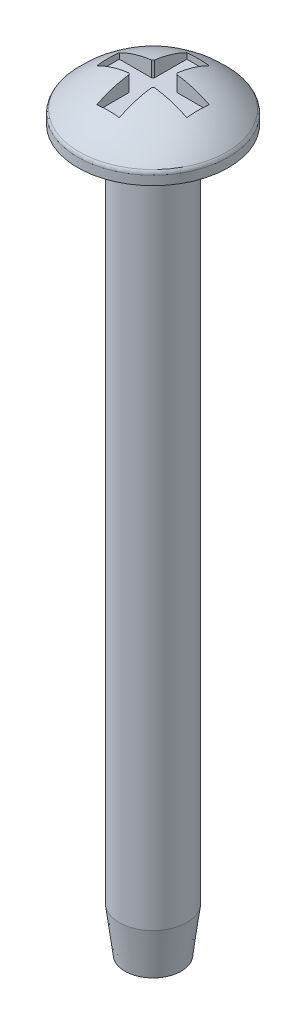
ISO-10303-21;
HEADER;
FILE_DESCRIPTION(('STEP AP214'),'2;1');
FILE_NAME('part.step','',(''),(''),'','','');
FILE_SCHEMA(('AUTOMOTIVE_DESIGN { 1 0 10303 214 1 1 1 1 }'));
ENDSEC;
DATA;
#1=APPLICATION_CONTEXT('core data for automotive mechanical design processes');
#2=APPLICATION_PROTOCOL_DEFINITION('international standard','automotive_design',2000,#1);
#3=PRODUCT_CONTEXT('',#1,'mechanical');
#4=PRODUCT('Part','Part','',(#3));
#5=PRODUCT_RELATED_PRODUCT_CATEGORY('part','',(#4));
#6=PRODUCT_DEFINITION_FORMATION('','',#4);
#7=PRODUCT_DEFINITION_CONTEXT('part definition',#1,'design');
#8=PRODUCT_DEFINITION('design','',#6,#7);
#9=PRODUCT_DEFINITION_SHAPE('','',#8);
#10=(LENGTH_UNIT() NAMED_UNIT(*) SI_UNIT(.MILLI.,.METRE.));
#11=(NAMED_UNIT(*) PLANE_ANGLE_UNIT() SI_UNIT($,.RADIAN.));
#12=(NAMED_UNIT(*) SI_UNIT($,.STERADIAN.) SOLID_ANGLE_UNIT());
#13=UNCERTAINTY_MEASURE_WITH_UNIT(LENGTH_MEASURE(1.E-05),#10,'distance_accuracy_value','');
#14=(GEOMETRIC_REPRESENTATION_CONTEXT(3) GLOBAL_UNCERTAINTY_ASSIGNED_CONTEXT((#13)) GLOBAL_UNIT_ASSIGNED_CONTEXT((#10,
#11,#12)) REPRESENTATION_CONTEXT('',''));
#15=CARTESIAN_POINT('',(0.,0.,0.));
#16=DIRECTION('',(0.,0.,1.));
#17=DIRECTION('',(1.,0.,0.));
#18=AXIS2_PLACEMENT_3D('',#15,#16,#17);
#19=CARTESIAN_POINT('',(0.,0.,0.));
#20=DIRECTION('',(0.,-1.,0.));
#21=DIRECTION('',(1.,0.,0.));
#22=AXIS2_PLACEMENT_3D('',#19,#20,#21);
#23=SPHERICAL_SURFACE('',#22,4.5);
#24=CARTESIAN_POINT('',(0.,3.07369941468059,0.));
#25=DIRECTION('',(0.,-1.,0.));
#26=DIRECTION('',(0.,0.,-1.));
#27=AXIS2_PLACEMENT_3D('',#24,#25,#26);
#28=CIRCLE('',#27,3.28669619955849);
#29=CARTESIAN_POINT('',(0.,3.07369941468059,-3.28669619955849));
#30=VERTEX_POINT('',#29);
#31=EDGE_CURVE('E173',#30,#30,#28,.F.);
#32=ORIENTED_EDGE('',*,*,#31,.T.);
#33=EDGE_LOOP('',(#32));
#34=FACE_BOUND('',#33,.T.);
#35=CARTESIAN_POINT('',(-0.5,0.,0.));
#36=DIRECTION('',(1.,0.,0.));
#37=DIRECTION('',(0.,0.,-1.));
#38=AXIS2_PLACEMENT_3D('',#35,#36,#37);
#39=CIRCLE('',#38,4.47213595499958);
#40=CARTESIAN_POINT('',(-0.5,4.43705983732471,-0.559016994374947));
#41=VERTEX_POINT('',#40);
#42=CARTESIAN_POINT('',(-0.5,4.,-2.));
#43=VERTEX_POINT('',#42);
#44=EDGE_CURVE('E182',#41,#43,#39,.F.);
#45=ORIENTED_EDGE('',*,*,#44,.T.);
#46=CARTESIAN_POINT('',(0.,0.,-2.));
#47=DIRECTION('',(0.,0.,1.));
#48=DIRECTION('',(1.,0.,0.));
#49=AXIS2_PLACEMENT_3D('',#46,#47,#48);
#50=CIRCLE('',#49,4.03112887414927);
#51=CARTESIAN_POINT('',(0.5,4.,-2.));
#52=VERTEX_POINT('',#51);
#53=EDGE_CURVE('E11',#43,#52,#50,.F.);
#54=ORIENTED_EDGE('',*,*,#53,.T.);
#55=CARTESIAN_POINT('',(0.5,0.,0.));
#56=DIRECTION('',(-1.,0.,0.));
#57=DIRECTION('',(0.,0.,1.));
#58=AXIS2_PLACEMENT_3D('',#55,#56,#57);
#59=CIRCLE('',#58,4.47213595499958);
#60=CARTESIAN_POINT('',(0.5,4.43705983732471,-0.559016994374947));
#61=VERTEX_POINT('',#60);
#62=EDGE_CURVE('E38',#52,#61,#59,.F.);
#63=ORIENTED_EDGE('',*,*,#62,.T.);
#64=CARTESIAN_POINT('',(0.,4.43705983732471,0.));
#65=DIRECTION('',(0.,-1.,0.));
#66=DIRECTION('',(0.,0.,-1.));
#67=AXIS2_PLACEMENT_3D('',#64,#65,#66);
#68=CIRCLE('',#67,0.75);
#69=CARTESIAN_POINT('',(0.559016994374942,4.43705983732471,-0.500000000000006));
#70=VERTEX_POINT('',#69);
#71=EDGE_CURVE('E221',#61,#70,#68,.T.);
#72=ORIENTED_EDGE('',*,*,#71,.T.);
#73=CARTESIAN_POINT('',(0.,0.,-0.5));
#74=DIRECTION('',(0.,0.,1.));
#75=DIRECTION('',(1.,0.,0.));
#76=AXIS2_PLACEMENT_3D('',#73,#74,#75);
#77=CIRCLE('',#76,4.47213595499958);
#78=CARTESIAN_POINT('',(1.99999999999999,4.,-0.500000000000021));
#79=VERTEX_POINT('',#78);
#80=EDGE_CURVE('E218',#70,#79,#77,.F.);
#81=ORIENTED_EDGE('',*,*,#80,.T.);
#82=CARTESIAN_POINT('',(2.,0.,0.));
#83=DIRECTION('',(-1.,0.,0.));
#84=DIRECTION('',(0.,0.,1.));
#85=AXIS2_PLACEMENT_3D('',#82,#83,#84);
#86=CIRCLE('',#85,4.03112887414927);
#87=CARTESIAN_POINT('',(2.00000000000001,4.,0.499999999999979));
#88=VERTEX_POINT('',#87);
#89=EDGE_CURVE('E215',#79,#88,#86,.F.);
#90=ORIENTED_EDGE('',*,*,#89,.T.);
#91=CARTESIAN_POINT('',(0.,0.,0.5));
#92=DIRECTION('',(0.,0.,-1.));
#93=DIRECTION('',(-1.,0.,0.));
#94=AXIS2_PLACEMENT_3D('',#91,#92,#93);
#95=CIRCLE('',#94,4.47213595499958);
#96=CARTESIAN_POINT('',(0.559016994374952,4.43705983732471,0.499999999999994));
#97=VERTEX_POINT('',#96);
#98=EDGE_CURVE('E212',#88,#97,#95,.F.);
#99=ORIENTED_EDGE('',*,*,#98,.T.);
#100=CARTESIAN_POINT('',(0.,4.43705983732471,0.));
#101=DIRECTION('',(0.,-1.,0.));
#102=DIRECTION('',(0.,0.,-1.));
#103=AXIS2_PLACEMENT_3D('',#100,#101,#102);
#104=CIRCLE('',#103,0.75);
#105=CARTESIAN_POINT('',(0.500000000000004,4.43705983732471,0.559016994374944));
#106=VERTEX_POINT('',#105);
#107=EDGE_CURVE('E209',#97,#106,#104,.T.);
#108=ORIENTED_EDGE('',*,*,#107,.T.);
#109=CARTESIAN_POINT('',(0.5,0.,0.));
#110=DIRECTION('',(-1.,0.,0.));
#111=DIRECTION('',(0.,0.,1.));
#112=AXIS2_PLACEMENT_3D('',#109,#110,#111);
#113=CIRCLE('',#112,4.47213595499958);
#114=CARTESIAN_POINT('',(0.500000000000014,4.,2.));
#115=VERTEX_POINT('',#114);
#116=EDGE_CURVE('E206',#106,#115,#113,.F.);
#117=ORIENTED_EDGE('',*,*,#116,.T.);
#118=CARTESIAN_POINT('',(0.,0.,2.));
#119=DIRECTION('',(0.,0.,-1.));
#120=DIRECTION('',(-1.,0.,0.));
#121=AXIS2_PLACEMENT_3D('',#118,#119,#120);
#122=CIRCLE('',#121,4.03112887414927);
#123=CARTESIAN_POINT('',(-0.499999999999986,4.,2.));
#124=VERTEX_POINT('',#123);
#125=EDGE_CURVE('E203',#115,#124,#122,.F.);
#126=ORIENTED_EDGE('',*,*,#125,.T.);
#127=CARTESIAN_POINT('',(-0.5,0.,0.));
#128=DIRECTION('',(1.,0.,0.));
#129=DIRECTION('',(0.,0.,-1.));
#130=AXIS2_PLACEMENT_3D('',#127,#128,#129);
#131=CIRCLE('',#130,4.47213595499958);
#132=CARTESIAN_POINT('',(-0.499999999999996,4.43705983732471,0.559016994374951));
#133=VERTEX_POINT('',#132);
#134=EDGE_CURVE('E200',#124,#133,#131,.F.);
#135=ORIENTED_EDGE('',*,*,#134,.T.);
#136=CARTESIAN_POINT('',(0.,4.43705983732471,0.));
#137=DIRECTION('',(0.,-1.,0.));
#138=DIRECTION('',(0.,0.,-1.));
#139=AXIS2_PLACEMENT_3D('',#136,#137,#138);
#140=CIRCLE('',#139,0.75);
#141=CARTESIAN_POINT('',(-0.559016994374946,4.43705983732471,0.500000000000002));
#142=VERTEX_POINT('',#141);
#143=EDGE_CURVE('E197',#133,#142,#140,.T.);
#144=ORIENTED_EDGE('',*,*,#143,.T.);
#145=CARTESIAN_POINT('',(0.,0.,0.5));
#146=DIRECTION('',(0.,0.,-1.));
#147=DIRECTION('',(-1.,0.,0.));
#148=AXIS2_PLACEMENT_3D('',#145,#146,#147);
#149=CIRCLE('',#148,4.47213595499958);
#150=CARTESIAN_POINT('',(-2.,4.,0.500000000000007));
#151=VERTEX_POINT('',#150);
#152=EDGE_CURVE('E194',#142,#151,#149,.F.);
#153=ORIENTED_EDGE('',*,*,#152,.T.);
#154=CARTESIAN_POINT('',(-2.,0.,0.));
#155=DIRECTION('',(1.,0.,0.));
#156=DIRECTION('',(0.,0.,-1.));
#157=AXIS2_PLACEMENT_3D('',#154,#155,#156);
#158=CIRCLE('',#157,4.03112887414927);
#159=CARTESIAN_POINT('',(-2.,4.,-0.499999999999993));
#160=VERTEX_POINT('',#159);
#161=EDGE_CURVE('E191',#151,#160,#158,.F.);
#162=ORIENTED_EDGE('',*,*,#161,.T.);
#163=CARTESIAN_POINT('',(0.,0.,-0.5));
#164=DIRECTION('',(0.,0.,1.));
#165=DIRECTION('',(1.,0.,0.));
#166=AXIS2_PLACEMENT_3D('',#163,#164,#165);
#167=CIRCLE('',#166,4.47213595499958);
#168=CARTESIAN_POINT('',(-0.559016994374949,4.43705983732471,-0.499999999999998));
#169=VERTEX_POINT('',#168);
#170=EDGE_CURVE('E188',#160,#169,#167,.F.);
#171=ORIENTED_EDGE('',*,*,#170,.T.);
#172=CARTESIAN_POINT('',(0.,4.43705983732471,0.));
#173=DIRECTION('',(0.,-1.,0.));
#174=DIRECTION('',(0.,0.,-1.));
#175=AXIS2_PLACEMENT_3D('',#172,#173,#174);
#176=CIRCLE('',#175,0.75);
#177=EDGE_CURVE('E185',#169,#41,#176,.T.);
#178=ORIENTED_EDGE('',*,*,#177,.T.);
#179=EDGE_LOOP('',(#45,#54,#63,#72,#81,#90,#99,#108,#117,#126,#135,#144,#153,#162,#171,#178));
#180=FACE_BOUND('',#179,.T.);
#181=ADVANCED_FACE('F31',(#34,#180),#23,.T.);
#182=CARTESIAN_POINT('',(0.,2.5,0.));
#183=DIRECTION('',(0.,-1.,0.));
#184=DIRECTION('',(0.,0.,-1.));
#185=AXIS2_PLACEMENT_3D('',#182,#183,#184);
#186=PLANE('',#185);
#187=CARTESIAN_POINT('',(0.,2.5,0.));
#188=DIRECTION('',(0.,-1.,0.));
#189=DIRECTION('',(0.,0.,-1.));
#190=AXIS2_PLACEMENT_3D('',#187,#188,#189);
#191=CIRCLE('',#190,3.35410196624968);
#192=CARTESIAN_POINT('',(0.,2.5,-3.35410196624968));
#193=VERTEX_POINT('',#192);
#194=EDGE_CURVE('E162',#193,#193,#191,.T.);
#195=ORIENTED_EDGE('',*,*,#194,.T.);
#196=EDGE_LOOP('',(#195));
#197=FACE_BOUND('',#196,.T.);
#198=CARTESIAN_POINT('',(0.,2.5,0.));
#199=DIRECTION('',(0.,-1.,0.));
#200=DIRECTION('',(0.,0.,-1.));
#201=AXIS2_PLACEMENT_3D('',#198,#199,#200);
#202=CIRCLE('',#201,1.5);
#203=CARTESIAN_POINT('',(0.,2.5,-1.5));
#204=VERTEX_POINT('',#203);
#205=EDGE_CURVE('E158',#204,#204,#202,.T.);
#206=ORIENTED_EDGE('',*,*,#205,.F.);
#207=EDGE_LOOP('',(#206));
#208=FACE_BOUND('',#207,.T.);
#209=ADVANCED_FACE('F349',(#197,#208),#186,.T.);
#210=CARTESIAN_POINT('',(0.,2.5,0.));
#211=DIRECTION('',(0.,1.,0.));
#212=DIRECTION('',(0.,0.,1.));
#213=AXIS2_PLACEMENT_3D('',#210,#211,#212);
#214=CYLINDRICAL_SURFACE('',#213,3.35410196624968);
#215=CARTESIAN_POINT('',(0.,2.90293833608722,0.));
#216=DIRECTION('',(0.,-1.,0.));
#217=DIRECTION('',(0.,0.,-1.));
#218=AXIS2_PLACEMENT_3D('',#215,#216,#217);
#219=CIRCLE('',#218,3.35410196624968);
#220=CARTESIAN_POINT('',(0.,2.90293833608722,-3.35410196624968));
#221=VERTEX_POINT('',#220);
#222=EDGE_CURVE('E170',#221,#221,#219,.T.);
#223=ORIENTED_EDGE('',*,*,#222,.T.);
#224=EDGE_LOOP('',(#223));
#225=FACE_BOUND('',#224,.T.);
#226=ORIENTED_EDGE('',*,*,#194,.F.);
#227=EDGE_LOOP('',(#226));
#228=FACE_BOUND('',#227,.T.);
#229=ADVANCED_FACE('F354',(#225,#228),#214,.T.);
#230=CARTESIAN_POINT('',(0.,2.90293833608722,0.));
#231=DIRECTION('',(0.,-1.,0.));
#232=DIRECTION('',(0.,0.,-1.));
#233=AXIS2_PLACEMENT_3D('',#230,#231,#232);
#234=TOROIDAL_SURFACE('',#233,3.10410196624968,0.25);
#235=ORIENTED_EDGE('',*,*,#31,.F.);
#236=EDGE_LOOP('',(#235));
#237=FACE_BOUND('',#236,.T.);
#238=ORIENTED_EDGE('',*,*,#222,.F.);
#239=EDGE_LOOP('',(#238));
#240=FACE_BOUND('',#239,.T.);
#241=ADVANCED_FACE('F359',(#237,#240),#234,.T.);
#242=CARTESIAN_POINT('',(0.,-29.5,0.));
#243=DIRECTION('',(0.,1.,0.));
#244=DIRECTION('',(0.,0.,1.));
#245=AXIS2_PLACEMENT_3D('',#242,#243,#244);
#246=CYLINDRICAL_SURFACE('',#245,1.5);
#247=CARTESIAN_POINT('',(0.,-27.5,0.));
#248=DIRECTION('',(0.,-1.,0.));
#249=DIRECTION('',(0.,0.,-1.));
#250=AXIS2_PLACEMENT_3D('',#247,#248,#249);
#251=CIRCLE('',#250,1.5);
#252=CARTESIAN_POINT('',(0.,-27.5,-1.5));
#253=VERTEX_POINT('',#252);
#254=EDGE_CURVE('E179',#253,#253,#251,.F.);
#255=ORIENTED_EDGE('',*,*,#254,.T.);
#256=EDGE_LOOP('',(#255));
#257=FACE_BOUND('',#256,.T.);
#258=ORIENTED_EDGE('',*,*,#205,.T.);
#259=EDGE_LOOP('',(#258));
#260=FACE_BOUND('',#259,.T.);
#261=ADVANCED_FACE('F362',(#257,#260),#246,.T.);
#262=CARTESIAN_POINT('',(0.,-29.5,0.));
#263=DIRECTION('',(0.,-1.,0.));
#264=DIRECTION('',(0.,0.,-1.));
#265=AXIS2_PLACEMENT_3D('',#262,#263,#264);
#266=PLANE('',#265);
#267=CARTESIAN_POINT('',(0.,-29.5,0.));
#268=DIRECTION('',(0.,-1.,0.));
#269=DIRECTION('',(0.,0.,-1.));
#270=AXIS2_PLACEMENT_3D('',#267,#268,#269);
#271=CIRCLE('',#270,1.25);
#272=CARTESIAN_POINT('',(0.,-29.5,-1.25));
#273=VERTEX_POINT('',#272);
#274=EDGE_CURVE('E176',#273,#273,#271,.T.);
#275=ORIENTED_EDGE('',*,*,#274,.T.);
#276=EDGE_LOOP('',(#275));
#277=FACE_BOUND('',#276,.T.);
#278=ADVANCED_FACE('F373',(#277),#266,.T.);
#279=CARTESIAN_POINT('',(0.,-29.5,0.));
#280=DIRECTION('',(0.,1.,0.));
#281=DIRECTION('',(0.,0.,1.));
#282=AXIS2_PLACEMENT_3D('',#279,#280,#281);
#283=CONICAL_SURFACE('',#282,1.25,0.124354994546762);
#284=ORIENTED_EDGE('',*,*,#254,.F.);
#285=EDGE_LOOP('',(#284));
#286=FACE_BOUND('',#285,.T.);
#287=ORIENTED_EDGE('',*,*,#274,.F.);
#288=EDGE_LOOP('',(#287));
#289=FACE_BOUND('',#288,.T.);
#290=ADVANCED_FACE('F379',(#286,#289),#283,.T.);
#291=CARTESIAN_POINT('',(-0.5,3.75,-2.));
#292=DIRECTION('',(0.,0.,1.));
#293=DIRECTION('',(1.,0.,0.));
#294=AXIS2_PLACEMENT_3D('',#291,#292,#293);
#295=PLANE('',#294);
#296=DIRECTION('',(0.,1.,0.));
#297=VECTOR('',#296,1.);
#298=CARTESIAN_POINT('',(-0.5,3.75,-2.));
#299=LINE('',#298,#297);
#300=CARTESIAN_POINT('',(-0.5,3.75,-2.));
#301=VERTEX_POINT('',#300);
#302=EDGE_CURVE('E45',#301,#43,#299,.T.);
#303=ORIENTED_EDGE('',*,*,#302,.F.);
#304=DIRECTION('',(1.,0.,0.));
#305=VECTOR('',#304,1.);
#306=CARTESIAN_POINT('',(-0.5,3.75,-2.));
#307=LINE('',#306,#305);
#308=CARTESIAN_POINT('',(0.5,3.75,-2.));
#309=VERTEX_POINT('',#308);
#310=EDGE_CURVE('E148',#301,#309,#307,.T.);
#311=ORIENTED_EDGE('',*,*,#310,.T.);
#312=DIRECTION('',(0.,1.,0.));
#313=VECTOR('',#312,1.);
#314=CARTESIAN_POINT('',(0.5,3.75,-2.));
#315=LINE('',#314,#313);
#316=EDGE_CURVE('E155',#309,#52,#315,.T.);
#317=ORIENTED_EDGE('',*,*,#316,.T.);
#318=ORIENTED_EDGE('',*,*,#53,.F.);
#319=EDGE_LOOP('',(#303,#311,#317,#318));
#320=FACE_BOUND('',#319,.T.);
#321=ADVANCED_FACE('F154',(#320),#295,.T.);
#322=CARTESIAN_POINT('',(0.5,3.75,-2.));
#323=DIRECTION('',(-1.,0.,0.));
#324=DIRECTION('',(0.,0.,1.));
#325=AXIS2_PLACEMENT_3D('',#322,#323,#324);
#326=PLANE('',#325);
#327=ORIENTED_EDGE('',*,*,#316,.F.);
#328=DIRECTION('',(0.,0.,1.));
#329=VECTOR('',#328,1.);
#330=CARTESIAN_POINT('',(0.5,3.75,-2.));
#331=LINE('',#330,#329);
#332=CARTESIAN_POINT('',(0.5,3.75,-0.559016994374947));
#333=VERTEX_POINT('',#332);
#334=EDGE_CURVE('E144',#309,#333,#331,.T.);
#335=ORIENTED_EDGE('',*,*,#334,.T.);
#336=DIRECTION('',(0.,1.,0.));
#337=VECTOR('',#336,1.);
#338=CARTESIAN_POINT('',(0.5,3.75,-0.559016994374947));
#339=LINE('',#338,#337);
#340=EDGE_CURVE('E159',#333,#61,#339,.T.);
#341=ORIENTED_EDGE('',*,*,#340,.T.);
#342=ORIENTED_EDGE('',*,*,#62,.F.);
#343=EDGE_LOOP('',(#327,#335,#341,#342));
#344=FACE_BOUND('',#343,.T.);
#345=ADVANCED_FACE('F157',(#344),#326,.T.);
#346=CARTESIAN_POINT('',(0.,3.75,0.));
#347=DIRECTION('',(0.,1.,0.));
#348=DIRECTION('',(0.,0.,1.));
#349=AXIS2_PLACEMENT_3D('',#346,#347,#348);
#350=CYLINDRICAL_SURFACE('',#349,0.75);
#351=ORIENTED_EDGE('',*,*,#340,.F.);
#352=CARTESIAN_POINT('',(0.,3.75,0.));
#353=DIRECTION('',(0.,-1.,0.));
#354=DIRECTION('',(0.,0.,-1.));
#355=AXIS2_PLACEMENT_3D('',#352,#353,#354);
#356=CIRCLE('',#355,0.75);
#357=CARTESIAN_POINT('',(0.559016994374942,3.75,-0.500000000000006));
#358=VERTEX_POINT('',#357);
#359=EDGE_CURVE('E150',#333,#358,#356,.T.);
#360=ORIENTED_EDGE('',*,*,#359,.T.);
#361=DIRECTION('',(0.,1.,0.));
#362=VECTOR('',#361,1.);
#363=CARTESIAN_POINT('',(0.559016994374942,3.75,-0.500000000000006));
#364=LINE('',#363,#362);
#365=EDGE_CURVE('E164',#358,#70,#364,.T.);
#366=ORIENTED_EDGE('',*,*,#365,.T.);
#367=ORIENTED_EDGE('',*,*,#71,.F.);
#368=EDGE_LOOP('',(#351,#360,#366,#367));
#369=FACE_BOUND('',#368,.T.);
#370=ADVANCED_FACE('F273',(#369),#350,.F.);
#371=CARTESIAN_POINT('',(1.99999999999999,3.75,-0.500000000000021));
#372=DIRECTION('',(0.,0.,1.));
#373=DIRECTION('',(1.,0.,0.));
#374=AXIS2_PLACEMENT_3D('',#371,#372,#373);
#375=PLANE('',#374);
#376=ORIENTED_EDGE('',*,*,#365,.F.);
#377=DIRECTION('',(1.,0.,0.));
#378=VECTOR('',#377,1.);
#379=CARTESIAN_POINT('',(1.99999999999999,3.75,-0.500000000000021));
#380=LINE('',#379,#378);
#381=CARTESIAN_POINT('',(1.99999999999999,3.75,-0.500000000000021));
#382=VERTEX_POINT('',#381);
#383=EDGE_CURVE('E276',#358,#382,#380,.T.);
#384=ORIENTED_EDGE('',*,*,#383,.T.);
#385=DIRECTION('',(0.,1.,0.));
#386=VECTOR('',#385,1.);
#387=CARTESIAN_POINT('',(1.99999999999999,3.75,-0.500000000000021));
#388=LINE('',#387,#386);
#389=EDGE_CURVE('E268',#382,#79,#388,.T.);
#390=ORIENTED_EDGE('',*,*,#389,.T.);
#391=ORIENTED_EDGE('',*,*,#80,.F.);
#392=EDGE_LOOP('',(#376,#384,#390,#391));
#393=FACE_BOUND('',#392,.T.);
#394=ADVANCED_FACE('F275',(#393),#375,.T.);
#395=CARTESIAN_POINT('',(1.99999999999999,3.75,-0.500000000000021));
#396=DIRECTION('',(-1.,0.,0.));
#397=DIRECTION('',(0.,0.,1.));
#398=AXIS2_PLACEMENT_3D('',#395,#396,#397);
#399=PLANE('',#398);
#400=ORIENTED_EDGE('',*,*,#389,.F.);
#401=DIRECTION('',(0.,0.,1.));
#402=VECTOR('',#401,1.);
#403=CARTESIAN_POINT('',(1.99999999999999,3.75,-0.500000000000021));
#404=LINE('',#403,#402);
#405=CARTESIAN_POINT('',(2.00000000000001,3.75,0.499999999999979));
#406=VERTEX_POINT('',#405);
#407=EDGE_CURVE('E280',#382,#406,#404,.T.);
#408=ORIENTED_EDGE('',*,*,#407,.T.);
#409=DIRECTION('',(0.,1.,0.));
#410=VECTOR('',#409,1.);
#411=CARTESIAN_POINT('',(2.00000000000001,3.75,0.499999999999979));
#412=LINE('',#411,#410);
#413=EDGE_CURVE('E265',#406,#88,#412,.T.);
#414=ORIENTED_EDGE('',*,*,#413,.T.);
#415=ORIENTED_EDGE('',*,*,#89,.F.);
#416=EDGE_LOOP('',(#400,#408,#414,#415));
#417=FACE_BOUND('',#416,.T.);
#418=ADVANCED_FACE('F339',(#417),#399,.T.);
#419=CARTESIAN_POINT('',(2.00000000000001,3.75,0.499999999999979));
#420=DIRECTION('',(0.,0.,-1.));
#421=DIRECTION('',(-1.,0.,0.));
#422=AXIS2_PLACEMENT_3D('',#419,#420,#421);
#423=PLANE('',#422);
#424=ORIENTED_EDGE('',*,*,#413,.F.);
#425=DIRECTION('',(-1.,0.,0.));
#426=VECTOR('',#425,1.);
#427=CARTESIAN_POINT('',(2.00000000000001,3.75,0.499999999999979));
#428=LINE('',#427,#426);
#429=CARTESIAN_POINT('',(0.559016994374952,3.75,0.499999999999994));
#430=VERTEX_POINT('',#429);
#431=EDGE_CURVE('E282',#406,#430,#428,.T.);
#432=ORIENTED_EDGE('',*,*,#431,.T.);
#433=DIRECTION('',(0.,1.,0.));
#434=VECTOR('',#433,1.);
#435=CARTESIAN_POINT('',(0.559016994374952,3.75,0.499999999999994));
#436=LINE('',#435,#434);
#437=EDGE_CURVE('E262',#430,#97,#436,.T.);
#438=ORIENTED_EDGE('',*,*,#437,.T.);
#439=ORIENTED_EDGE('',*,*,#98,.F.);
#440=EDGE_LOOP('',(#424,#432,#438,#439));
#441=FACE_BOUND('',#440,.T.);
#442=ADVANCED_FACE('F337',(#441),#423,.T.);
#443=CARTESIAN_POINT('',(0.,3.75,0.));
#444=DIRECTION('',(0.,1.,0.));
#445=DIRECTION('',(0.,0.,1.));
#446=AXIS2_PLACEMENT_3D('',#443,#444,#445);
#447=CYLINDRICAL_SURFACE('',#446,0.75);
#448=ORIENTED_EDGE('',*,*,#437,.F.);
#449=CARTESIAN_POINT('',(0.,3.75,0.));
#450=DIRECTION('',(0.,-1.,0.));
#451=DIRECTION('',(0.,0.,-1.));
#452=AXIS2_PLACEMENT_3D('',#449,#450,#451);
#453=CIRCLE('',#452,0.75);
#454=CARTESIAN_POINT('',(0.500000000000004,3.75,0.559016994374944));
#455=VERTEX_POINT('',#454);
#456=EDGE_CURVE('E287',#430,#455,#453,.T.);
#457=ORIENTED_EDGE('',*,*,#456,.T.);
#458=DIRECTION('',(0.,1.,0.));
#459=VECTOR('',#458,1.);
#460=CARTESIAN_POINT('',(0.500000000000004,3.75,0.559016994374944));
#461=LINE('',#460,#459);
#462=EDGE_CURVE('E259',#455,#106,#461,.T.);
#463=ORIENTED_EDGE('',*,*,#462,.T.);
#464=ORIENTED_EDGE('',*,*,#107,.F.);
#465=EDGE_LOOP('',(#448,#457,#463,#464));
#466=FACE_BOUND('',#465,.T.);
#467=ADVANCED_FACE('F333',(#466),#447,.F.);
#468=CARTESIAN_POINT('',(0.500000000000014,3.75,2.));
#469=DIRECTION('',(-1.,0.,0.));
#470=DIRECTION('',(0.,0.,1.));
#471=AXIS2_PLACEMENT_3D('',#468,#469,#470);
#472=PLANE('',#471);
#473=ORIENTED_EDGE('',*,*,#462,.F.);
#474=DIRECTION('',(0.,0.,1.));
#475=VECTOR('',#474,1.);
#476=CARTESIAN_POINT('',(0.500000000000014,3.75,2.));
#477=LINE('',#476,#475);
#478=CARTESIAN_POINT('',(0.500000000000014,3.75,2.));
#479=VERTEX_POINT('',#478);
#480=EDGE_CURVE('E289',#455,#479,#477,.T.);
#481=ORIENTED_EDGE('',*,*,#480,.T.);
#482=DIRECTION('',(0.,1.,0.));
#483=VECTOR('',#482,1.);
#484=CARTESIAN_POINT('',(0.500000000000014,3.75,2.));
#485=LINE('',#484,#483);
#486=EDGE_CURVE('E256',#479,#115,#485,.T.);
#487=ORIENTED_EDGE('',*,*,#486,.T.);
#488=ORIENTED_EDGE('',*,*,#116,.F.);
#489=EDGE_LOOP('',(#473,#481,#487,#488));
#490=FACE_BOUND('',#489,.T.);
#491=ADVANCED_FACE('F330',(#490),#472,.T.);
#492=CARTESIAN_POINT('',(0.500000000000014,3.75,2.));
#493=DIRECTION('',(0.,0.,-1.));
#494=DIRECTION('',(-1.,0.,0.));
#495=AXIS2_PLACEMENT_3D('',#492,#493,#494);
#496=PLANE('',#495);
#497=ORIENTED_EDGE('',*,*,#486,.F.);
#498=DIRECTION('',(-1.,0.,0.));
#499=VECTOR('',#498,1.);
#500=CARTESIAN_POINT('',(0.500000000000014,3.75,2.));
#501=LINE('',#500,#499);
#502=CARTESIAN_POINT('',(-0.499999999999986,3.75,2.));
#503=VERTEX_POINT('',#502);
#504=EDGE_CURVE('E291',#479,#503,#501,.T.);
#505=ORIENTED_EDGE('',*,*,#504,.T.);
#506=DIRECTION('',(0.,1.,0.));
#507=VECTOR('',#506,1.);
#508=CARTESIAN_POINT('',(-0.499999999999986,3.75,2.));
#509=LINE('',#508,#507);
#510=EDGE_CURVE('E253',#503,#124,#509,.T.);
#511=ORIENTED_EDGE('',*,*,#510,.T.);
#512=ORIENTED_EDGE('',*,*,#125,.F.);
#513=EDGE_LOOP('',(#497,#505,#511,#512));
#514=FACE_BOUND('',#513,.T.);
#515=ADVANCED_FACE('F327',(#514),#496,.T.);
#516=CARTESIAN_POINT('',(-0.499999999999986,3.75,2.));
#517=DIRECTION('',(1.,0.,0.));
#518=DIRECTION('',(0.,0.,-1.));
#519=AXIS2_PLACEMENT_3D('',#516,#517,#518);
#520=PLANE('',#519);
#521=ORIENTED_EDGE('',*,*,#510,.F.);
#522=DIRECTION('',(0.,0.,-1.));
#523=VECTOR('',#522,1.);
#524=CARTESIAN_POINT('',(-0.499999999999986,3.75,2.));
#525=LINE('',#524,#523);
#526=CARTESIAN_POINT('',(-0.499999999999996,3.75,0.559016994374951));
#527=VERTEX_POINT('',#526);
#528=EDGE_CURVE('E293',#503,#527,#525,.T.);
#529=ORIENTED_EDGE('',*,*,#528,.T.);
#530=DIRECTION('',(0.,1.,0.));
#531=VECTOR('',#530,1.);
#532=CARTESIAN_POINT('',(-0.499999999999996,3.75,0.559016994374951));
#533=LINE('',#532,#531);
#534=EDGE_CURVE('E250',#527,#133,#533,.T.);
#535=ORIENTED_EDGE('',*,*,#534,.T.);
#536=ORIENTED_EDGE('',*,*,#134,.F.);
#537=EDGE_LOOP('',(#521,#529,#535,#536));
#538=FACE_BOUND('',#537,.T.);
#539=ADVANCED_FACE('F324',(#538),#520,.T.);
#540=CARTESIAN_POINT('',(0.,3.75,0.));
#541=DIRECTION('',(0.,1.,0.));
#542=DIRECTION('',(0.,0.,1.));
#543=AXIS2_PLACEMENT_3D('',#540,#541,#542);
#544=CYLINDRICAL_SURFACE('',#543,0.75);
#545=ORIENTED_EDGE('',*,*,#534,.F.);
#546=CARTESIAN_POINT('',(0.,3.75,0.));
#547=DIRECTION('',(0.,-1.,0.));
#548=DIRECTION('',(0.,0.,-1.));
#549=AXIS2_PLACEMENT_3D('',#546,#547,#548);
#550=CIRCLE('',#549,0.75);
#551=CARTESIAN_POINT('',(-0.559016994374946,3.75,0.500000000000002));
#552=VERTEX_POINT('',#551);
#553=EDGE_CURVE('E295',#527,#552,#550,.T.);
#554=ORIENTED_EDGE('',*,*,#553,.T.);
#555=DIRECTION('',(0.,1.,0.));
#556=VECTOR('',#555,1.);
#557=CARTESIAN_POINT('',(-0.559016994374946,3.75,0.500000000000002));
#558=LINE('',#557,#556);
#559=EDGE_CURVE('E247',#552,#142,#558,.T.);
#560=ORIENTED_EDGE('',*,*,#559,.T.);
#561=ORIENTED_EDGE('',*,*,#143,.F.);
#562=EDGE_LOOP('',(#545,#554,#560,#561));
#563=FACE_BOUND('',#562,.T.);
#564=ADVANCED_FACE('F317',(#563),#544,.F.);
#565=CARTESIAN_POINT('',(-2.,3.75,0.500000000000007));
#566=DIRECTION('',(0.,0.,-1.));
#567=DIRECTION('',(-1.,0.,0.));
#568=AXIS2_PLACEMENT_3D('',#565,#566,#567);
#569=PLANE('',#568);
#570=ORIENTED_EDGE('',*,*,#559,.F.);
#571=DIRECTION('',(-1.,0.,0.));
#572=VECTOR('',#571,1.);
#573=CARTESIAN_POINT('',(-2.,3.75,0.500000000000007));
#574=LINE('',#573,#572);
#575=CARTESIAN_POINT('',(-2.,3.75,0.500000000000007));
#576=VERTEX_POINT('',#575);
#577=EDGE_CURVE('E297',#552,#576,#574,.T.);
#578=ORIENTED_EDGE('',*,*,#577,.T.);
#579=DIRECTION('',(0.,1.,0.));
#580=VECTOR('',#579,1.);
#581=CARTESIAN_POINT('',(-2.,3.75,0.500000000000007));
#582=LINE('',#581,#580);
#583=EDGE_CURVE('E244',#576,#151,#582,.T.);
#584=ORIENTED_EDGE('',*,*,#583,.T.);
#585=ORIENTED_EDGE('',*,*,#152,.F.);
#586=EDGE_LOOP('',(#570,#578,#584,#585));
#587=FACE_BOUND('',#586,.T.);
#588=ADVANCED_FACE('F314',(#587),#569,.T.);
#589=CARTESIAN_POINT('',(-2.,3.75,0.500000000000007));
#590=DIRECTION('',(1.,0.,0.));
#591=DIRECTION('',(0.,0.,-1.));
#592=AXIS2_PLACEMENT_3D('',#589,#590,#591);
#593=PLANE('',#592);
#594=ORIENTED_EDGE('',*,*,#583,.F.);
#595=DIRECTION('',(0.,0.,-1.));
#596=VECTOR('',#595,1.);
#597=CARTESIAN_POINT('',(-2.,3.75,0.500000000000007));
#598=LINE('',#597,#596);
#599=CARTESIAN_POINT('',(-2.,3.75,-0.499999999999993));
#600=VERTEX_POINT('',#599);
#601=EDGE_CURVE('E299',#576,#600,#598,.T.);
#602=ORIENTED_EDGE('',*,*,#601,.T.);
#603=DIRECTION('',(0.,1.,0.));
#604=VECTOR('',#603,1.);
#605=CARTESIAN_POINT('',(-2.,3.75,-0.499999999999993));
#606=LINE('',#605,#604);
#607=EDGE_CURVE('E236',#600,#160,#606,.T.);
#608=ORIENTED_EDGE('',*,*,#607,.T.);
#609=ORIENTED_EDGE('',*,*,#161,.F.);
#610=EDGE_LOOP('',(#594,#602,#608,#609));
#611=FACE_BOUND('',#610,.T.);
#612=ADVANCED_FACE('F311',(#611),#593,.T.);
#613=CARTESIAN_POINT('',(-2.,3.75,-0.499999999999993));
#614=DIRECTION('',(0.,0.,1.));
#615=DIRECTION('',(1.,0.,0.));
#616=AXIS2_PLACEMENT_3D('',#613,#614,#615);
#617=PLANE('',#616);
#618=ORIENTED_EDGE('',*,*,#607,.F.);
#619=DIRECTION('',(1.,0.,0.));
#620=VECTOR('',#619,1.);
#621=CARTESIAN_POINT('',(-2.,3.75,-0.499999999999993));
#622=LINE('',#621,#620);
#623=CARTESIAN_POINT('',(-0.559016994374949,3.75,-0.499999999999998));
#624=VERTEX_POINT('',#623);
#625=EDGE_CURVE('E301',#600,#624,#622,.T.);
#626=ORIENTED_EDGE('',*,*,#625,.T.);
#627=DIRECTION('',(0.,1.,0.));
#628=VECTOR('',#627,1.);
#629=CARTESIAN_POINT('',(-0.559016994374949,3.75,-0.499999999999998));
#630=LINE('',#629,#628);
#631=EDGE_CURVE('E234',#624,#169,#630,.T.);
#632=ORIENTED_EDGE('',*,*,#631,.T.);
#633=ORIENTED_EDGE('',*,*,#170,.F.);
#634=EDGE_LOOP('',(#618,#626,#632,#633));
#635=FACE_BOUND('',#634,.T.);
#636=ADVANCED_FACE('F308',(#635),#617,.T.);
#637=CARTESIAN_POINT('',(0.,3.75,0.));
#638=DIRECTION('',(0.,1.,0.));
#639=DIRECTION('',(0.,0.,1.));
#640=AXIS2_PLACEMENT_3D('',#637,#638,#639);
#641=CYLINDRICAL_SURFACE('',#640,0.75);
#642=ORIENTED_EDGE('',*,*,#631,.F.);
#643=CARTESIAN_POINT('',(0.,3.75,0.));
#644=DIRECTION('',(0.,-1.,0.));
#645=DIRECTION('',(0.,0.,-1.));
#646=AXIS2_PLACEMENT_3D('',#643,#644,#645);
#647=CIRCLE('',#646,0.75);
#648=CARTESIAN_POINT('',(-0.5,3.75,-0.559016994374947));
#649=VERTEX_POINT('',#648);
#650=EDGE_CURVE('E233',#624,#649,#647,.T.);
#651=ORIENTED_EDGE('',*,*,#650,.T.);
#652=DIRECTION('',(0.,1.,0.));
#653=VECTOR('',#652,1.);
#654=CARTESIAN_POINT('',(-0.5,3.75,-0.559016994374947));
#655=LINE('',#654,#653);
#656=EDGE_CURVE('E227',#649,#41,#655,.T.);
#657=ORIENTED_EDGE('',*,*,#656,.T.);
#658=ORIENTED_EDGE('',*,*,#177,.F.);
#659=EDGE_LOOP('',(#642,#651,#657,#658));
#660=FACE_BOUND('',#659,.T.);
#661=ADVANCED_FACE('F230',(#660),#641,.F.);
#662=CARTESIAN_POINT('',(-0.5,3.75,-2.));
#663=DIRECTION('',(1.,0.,0.));
#664=DIRECTION('',(0.,0.,-1.));
#665=AXIS2_PLACEMENT_3D('',#662,#663,#664);
#666=PLANE('',#665);
#667=ORIENTED_EDGE('',*,*,#656,.F.);
#668=DIRECTION('',(0.,0.,-1.));
#669=VECTOR('',#668,1.);
#670=CARTESIAN_POINT('',(-0.5,3.75,-2.));
#671=LINE('',#670,#669);
#672=EDGE_CURVE('E238',#649,#301,#671,.T.);
#673=ORIENTED_EDGE('',*,*,#672,.T.);
#674=ORIENTED_EDGE('',*,*,#302,.T.);
#675=ORIENTED_EDGE('',*,*,#44,.F.);
#676=EDGE_LOOP('',(#667,#673,#674,#675));
#677=FACE_BOUND('',#676,.T.);
#678=ADVANCED_FACE('F226',(#677),#666,.T.);
#679=CARTESIAN_POINT('',(0.,3.75,0.));
#680=DIRECTION('',(0.,-1.,0.));
#681=DIRECTION('',(0.,0.,-1.));
#682=AXIS2_PLACEMENT_3D('',#679,#680,#681);
#683=PLANE('',#682);
#684=ORIENTED_EDGE('',*,*,#310,.F.);
#685=ORIENTED_EDGE('',*,*,#672,.F.);
#686=ORIENTED_EDGE('',*,*,#650,.F.);
#687=ORIENTED_EDGE('',*,*,#625,.F.);
#688=ORIENTED_EDGE('',*,*,#601,.F.);
#689=ORIENTED_EDGE('',*,*,#577,.F.);
#690=ORIENTED_EDGE('',*,*,#553,.F.);
#691=ORIENTED_EDGE('',*,*,#528,.F.);
#692=ORIENTED_EDGE('',*,*,#504,.F.);
#693=ORIENTED_EDGE('',*,*,#480,.F.);
#694=ORIENTED_EDGE('',*,*,#456,.F.);
#695=ORIENTED_EDGE('',*,*,#431,.F.);
#696=ORIENTED_EDGE('',*,*,#407,.F.);
#697=ORIENTED_EDGE('',*,*,#383,.F.);
#698=ORIENTED_EDGE('',*,*,#359,.F.);
#699=ORIENTED_EDGE('',*,*,#334,.F.);
#700=EDGE_LOOP('',(#684,#685,#686,#687,#688,#689,#690,#691,#692,#693,#694,#695,#696,#697,#698,#699));
#701=FACE_BOUND('',#700,.T.);
#702=ADVANCED_FACE('F146',(#701),#683,.F.);
#703=CLOSED_SHELL('',(#181,#209,#229,#241,#261,#278,#290,#321,#345,#370,#394,#418,#442,#467,
#491,#515,#539,#564,#588,#612,#636,#661,#678,#702));
#704=MANIFOLD_SOLID_BREP('B2',#703);
#705=ADVANCED_BREP_SHAPE_REPRESENTATION('',(#18,#704),#14);
#706=SHAPE_DEFINITION_REPRESENTATION(#9,#705);
ENDSEC;
END-ISO-10303-21;
